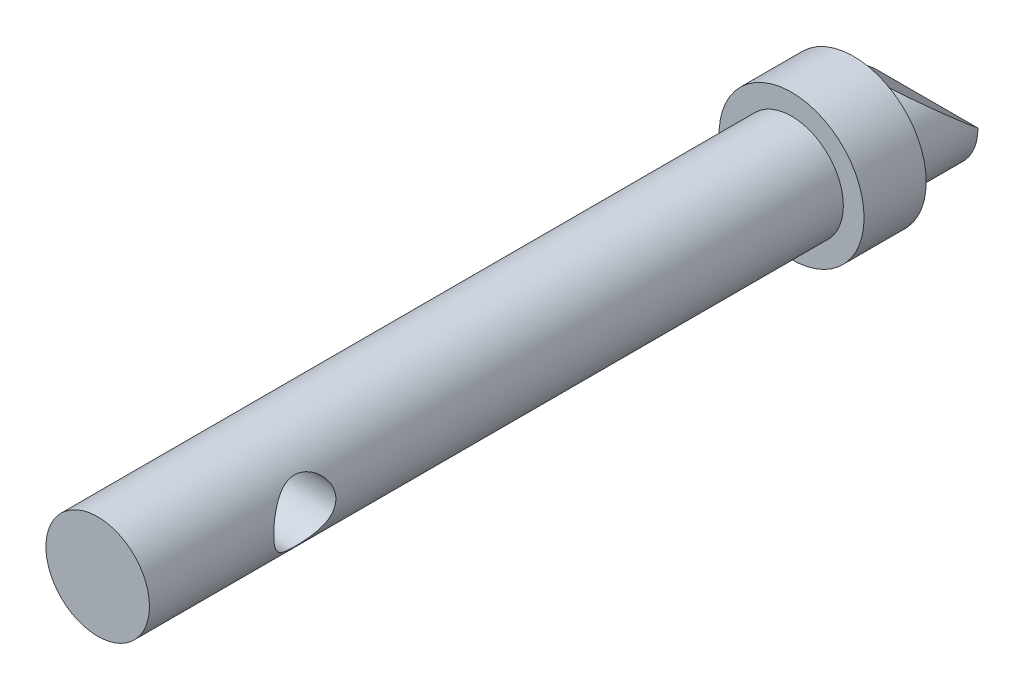
ISO-10303-21;
HEADER;
FILE_DESCRIPTION(('STEP AP214'),'2;1');
FILE_NAME('part.step','',(''),(''),'','','');
FILE_SCHEMA(('AUTOMOTIVE_DESIGN { 1 0 10303 214 1 1 1 1 }'));
ENDSEC;
DATA;
#1=APPLICATION_CONTEXT('core data for automotive mechanical design processes');
#2=APPLICATION_PROTOCOL_DEFINITION('international standard','automotive_design',2000,#1);
#3=PRODUCT_CONTEXT('',#1,'mechanical');
#4=PRODUCT('Part','Part','',(#3));
#5=PRODUCT_RELATED_PRODUCT_CATEGORY('part','',(#4));
#6=PRODUCT_DEFINITION_FORMATION('','',#4);
#7=PRODUCT_DEFINITION_CONTEXT('part definition',#1,'design');
#8=PRODUCT_DEFINITION('design','',#6,#7);
#9=PRODUCT_DEFINITION_SHAPE('','',#8);
#10=(LENGTH_UNIT() NAMED_UNIT(*) SI_UNIT(.MILLI.,.METRE.));
#11=(NAMED_UNIT(*) PLANE_ANGLE_UNIT() SI_UNIT($,.RADIAN.));
#12=(NAMED_UNIT(*) SI_UNIT($,.STERADIAN.) SOLID_ANGLE_UNIT());
#13=UNCERTAINTY_MEASURE_WITH_UNIT(LENGTH_MEASURE(1.E-05),#10,'distance_accuracy_value','');
#14=(GEOMETRIC_REPRESENTATION_CONTEXT(3) GLOBAL_UNCERTAINTY_ASSIGNED_CONTEXT((#13)) GLOBAL_UNIT_ASSIGNED_CONTEXT((#10,
#11,#12)) REPRESENTATION_CONTEXT('',''));
#15=CARTESIAN_POINT('',(0.,0.,0.));
#16=DIRECTION('',(0.,0.,1.));
#17=DIRECTION('',(1.,0.,0.));
#18=AXIS2_PLACEMENT_3D('',#15,#16,#17);
#19=CARTESIAN_POINT('',(0.,0.,-5.));
#20=DIRECTION('',(0.,0.,1.));
#21=DIRECTION('',(1.,0.,0.));
#22=AXIS2_PLACEMENT_3D('',#19,#20,#21);
#23=CYLINDRICAL_SURFACE('',#22,2.5);
#24=CARTESIAN_POINT('',(-2.5,0.,29.));
#25=CARTESIAN_POINT('',(-2.49999625789732,-0.0767298334620157,28.9999959089901));
#26=CARTESIAN_POINT('',(-2.4964290461501,-0.153582320644178,28.9940713290737));
#27=CARTESIAN_POINT('',(-2.48249903608568,-0.304975509530679,28.9706756804847));
#28=CARTESIAN_POINT('',(-2.47211948032719,-0.379510034596047,28.9531761381458));
#29=CARTESIAN_POINT('',(-2.44561558054488,-0.523751827790836,28.9076136388331));
#30=CARTESIAN_POINT('',(-2.42951973272944,-0.593481028226566,28.8796030418368));
#31=CARTESIAN_POINT('',(-2.39295367626407,-0.727030318214659,28.814139666859));
#32=CARTESIAN_POINT('',(-2.37248455380255,-0.790851869416383,28.7766892330313));
#33=CARTESIAN_POINT('',(-2.32705360719088,-0.916299278999314,28.6902251732914));
#34=CARTESIAN_POINT('',(-2.30186792195985,-0.977384020081414,28.6405463046486));
#35=CARTESIAN_POINT('',(-2.25030439279634,-1.09088270411891,28.5325327961717));
#36=CARTESIAN_POINT('',(-2.22392505153571,-1.14328534948112,28.4741870628127));
#37=CARTESIAN_POINT('',(-2.1691106699591,-1.24444996762974,28.3420764895033));
#38=CARTESIAN_POINT('',(-2.14082017703649,-1.29197766378809,28.2672982290187));
#39=CARTESIAN_POINT('',(-2.08938301412124,-1.37361437764896,28.1091534267569));
#40=CARTESIAN_POINT('',(-2.06622802273938,-1.40774517335159,28.0258011037524));
#41=CARTESIAN_POINT('',(-2.0335462966093,-1.45440601714221,27.8734035493468));
#42=CARTESIAN_POINT('',(-2.02207883137591,-1.47016197246826,27.8057640013897));
#43=CARTESIAN_POINT('',(-2.00590308295503,-1.49216172340475,27.6681962841696));
#44=CARTESIAN_POINT('',(-2.00118639643759,-1.49841734556836,27.5982710712455));
#45=CARTESIAN_POINT('',(-1.99920922463856,-1.50105508796009,27.4579885057827));
#46=CARTESIAN_POINT('',(-2.00196337012718,-1.49741783408419,27.3876305749068));
#47=CARTESIAN_POINT('',(-2.01453261443741,-1.48046060478828,27.2487212245724));
#48=CARTESIAN_POINT('',(-2.02435302432226,-1.46713334620103,27.1801712041526));
#49=CARTESIAN_POINT('',(-2.04953186944258,-1.43173921881793,27.0474697578719));
#50=CARTESIAN_POINT('',(-2.06481711652537,-1.40978748666087,26.9832729460755));
#51=CARTESIAN_POINT('',(-2.09927051350828,-1.35795061770837,26.8593050090719));
#52=CARTESIAN_POINT('',(-2.11844008623465,-1.32806257259705,26.7995355165761));
#53=CARTESIAN_POINT('',(-2.16255327268985,-1.25517983184583,26.6750159028772));
#54=CARTESIAN_POINT('',(-2.18792043372992,-1.21080724397723,26.6112219070451));
#55=CARTESIAN_POINT('',(-2.23930599764381,-1.11291092784003,26.491323516333));
#56=CARTESIAN_POINT('',(-2.26532500262149,-1.05937845100579,26.4352265660235));
#57=CARTESIAN_POINT('',(-2.31935504958317,-0.935811834382969,26.3243870181782));
#58=CARTESIAN_POINT('',(-2.34713836268532,-0.86451768270496,26.270922693984));
#59=CARTESIAN_POINT('',(-2.3977242843398,-0.712276050459002,26.1768779528021));
#60=CARTESIAN_POINT('',(-2.42052955425515,-0.631333763943566,26.13629064621));
#61=CARTESIAN_POINT('',(-2.45730392066151,-0.467197585268208,26.0720678172041));
#62=CARTESIAN_POINT('',(-2.47173957439704,-0.384467624173582,26.0475246442841));
#63=CARTESIAN_POINT('',(-2.4921884281355,-0.215047895144642,26.0129888025946));
#64=CARTESIAN_POINT('',(-2.49821172952738,-0.128363005661321,26.0029786822464));
#65=CARTESIAN_POINT('',(-2.5009057037461,0.0337146143773946,25.9984921523217));
#66=CARTESIAN_POINT('',(-2.49873521714286,0.109042473418716,26.0020911449148));
#67=CARTESIAN_POINT('',(-2.48778712087048,0.257829401986059,26.0204258530719));
#68=CARTESIAN_POINT('',(-2.47900964518037,0.331288509376104,26.0351613428058));
#69=CARTESIAN_POINT('',(-2.4559479244219,0.472574932157612,26.0745434328125));
#70=CARTESIAN_POINT('',(-2.44180275662555,0.540495750928483,26.0989403490735));
#71=CARTESIAN_POINT('',(-2.40913880862844,0.671265749087262,26.1566773763653));
#72=CARTESIAN_POINT('',(-2.39061916586511,0.734113924963907,26.1900192513467));
#73=CARTESIAN_POINT('',(-2.3484549623736,0.860006262823863,26.2685569792087));
#74=CARTESIAN_POINT('',(-2.3244780273988,0.922394150456837,26.3146238290784));
#75=CARTESIAN_POINT('',(-2.27474265574731,1.03902603131014,26.4153913934886));
#76=CARTESIAN_POINT('',(-2.2489821658636,1.09326040273738,26.4701021548525));
#77=CARTESIAN_POINT('',(-2.19445423909891,1.19931996735579,26.5949103900371));
#78=CARTESIAN_POINT('',(-2.16573241746291,1.24991019630915,26.6660838854655));
#79=CARTESIAN_POINT('',(-2.1121618206671,1.33845238915667,26.8172160245682));
#80=CARTESIAN_POINT('',(-2.0873089799769,1.37641766769781,26.8971652938928));
#81=CARTESIAN_POINT('',(-2.04984909240519,1.43142578795776,27.0462430223067));
#82=CARTESIAN_POINT('',(-2.03575659328728,1.4512162533619,27.1139803123586));
#83=CARTESIAN_POINT('',(-2.01409605743544,1.48113663905972,27.2525320780801));
#84=CARTESIAN_POINT('',(-2.00651897642721,1.49127995297631,27.3233421443278));
#85=CARTESIAN_POINT('',(-1.99900446616267,1.50134130416631,27.466376947597));
#86=CARTESIAN_POINT('',(-1.99909576445937,1.50122089107869,27.538605990687));
#87=CARTESIAN_POINT('',(-2.0069771789285,1.49066472959328,27.6818944356095));
#88=CARTESIAN_POINT('',(-2.0147714813882,1.48022337215759,27.7529531800806));
#89=CARTESIAN_POINT('',(-2.0363318524298,1.45040174148913,27.8884884175722));
#90=CARTESIAN_POINT('',(-2.04979211805581,1.43147636845351,27.9531170943069));
#91=CARTESIAN_POINT('',(-2.08105501960152,1.38563242076993,28.0783372544742));
#92=CARTESIAN_POINT('',(-2.09885929040482,1.35871083588479,28.1389272069606));
#93=CARTESIAN_POINT('',(-2.14012990550917,1.29289245555732,28.2643198572208));
#94=CARTESIAN_POINT('',(-2.1640458758264,1.25279167675753,28.3283411038543));
#95=CARTESIAN_POINT('',(-2.21320127030768,1.16375698389084,28.4493800726173));
#96=CARTESIAN_POINT('',(-2.23844177205021,1.11481579607798,28.5063919621526));
#97=CARTESIAN_POINT('',(-2.29225690291476,1.00009777425734,28.6213509491317));
#98=CARTESIAN_POINT('',(-2.32070308663658,0.932876819313901,28.6779310748962));
#99=CARTESIAN_POINT('',(-2.37365428872367,0.788462434445586,28.7790978558633));
#100=CARTESIAN_POINT('',(-2.39815789310936,0.711265444501537,28.8236802119848));
#101=CARTESIAN_POINT('',(-2.43985578654394,0.551125230801451,28.8977858075737));
#102=CARTESIAN_POINT('',(-2.45725077479787,0.468430086957212,28.9277280649268));
#103=CARTESIAN_POINT('',(-2.48366273001246,0.297973306118806,28.972724695211));
#104=CARTESIAN_POINT('',(-2.49271125871485,0.21023209964861,28.987835167857));
#105=CARTESIAN_POINT('',(-2.49802001168187,0.101558096917533,28.9966974547087));
#106=CARTESIAN_POINT('',(-2.49876114656362,0.0812762590282753,28.9979344173061));
#107=CARTESIAN_POINT('',(-2.49975164517367,0.0406658206871112,28.9995862463709));
#108=CARTESIAN_POINT('',(-2.50000099184316,0.0203372186375689,29.0000010843209));
#109=CARTESIAN_POINT('',(-2.5,0.,29.));
#110=B_SPLINE_CURVE_WITH_KNOTS('',3,(#24,#25,#26,#27,#28,#29,#30,#31,#32,#33,#34,#35,#36,#37,
#38,#39,#40,#41,#42,#43,#44,#45,#46,#47,#48,#49,#50,#51,#52,#53,#54,#55,#56,#57,#58,#59,#60,#61,
#62,#63,#64,#65,#66,#67,#68,#69,#70,#71,#72,#73,#74,#75,#76,#77,#78,#79,#80,#81,#82,#83,#84,#85,
#86,#87,#88,#89,#90,#91,#92,#93,#94,#95,#96,#97,#98,#99,#100,#101,#102,#103,#104,#105,#106,#107,
#108,#109),.UNSPECIFIED.,.T.,.F.,(4,2,2,2,2,2,2,2,2,2,2,2,2,2,2,2,2,2,2,2,2,2,2,2,2,2,2,2,2,2,2,
2,2,2,2,2,2,2,2,2,2,2,4),(0.,0.230102237548649,0.460772627520012,0.690308884600011,
0.919788197992275,1.16681590732472,1.414162579348,1.69183813189807,1.96906040692091,
2.17933829855633,2.38935420916578,2.59978170870726,2.81036753273872,3.01823267593207,
3.22617409809868,3.47046995225163,3.71500044803674,3.99360957884691,4.27206939275324,
4.53296790696559,4.79355286918236,5.01875602722426,5.24395461863455,5.46367785689772,
5.68344445659025,5.92601365818362,6.16886690081836,6.44336762428009,6.71757792616456,
6.93257787314692,7.14727888733319,7.36278425777433,7.57840681155725,7.78364098331143,
7.98895251523036,8.22578610052287,8.46281544370208,8.73854311775519,9.01436946031986,
9.28175654462677,9.54812832184449,9.60911473335177,9.67010326027641),.UNSPECIFIED.);
#111=CARTESIAN_POINT('',(-2.5,0.,29.));
#112=VERTEX_POINT('',#111);
#113=EDGE_CURVE('E58',#112,#112,#110,.T.);
#114=ORIENTED_EDGE('',*,*,#113,.T.);
#115=EDGE_LOOP('',(#114));
#116=FACE_BOUND('',#115,.T.);
#117=CARTESIAN_POINT('',(0.,0.,1.5));
#118=DIRECTION('',(0.,0.,1.));
#119=DIRECTION('',(1.,0.,0.));
#120=AXIS2_PLACEMENT_3D('',#117,#118,#119);
#121=CIRCLE('',#120,2.5);
#122=CARTESIAN_POINT('',(2.5,0.,1.5));
#123=VERTEX_POINT('',#122);
#124=EDGE_CURVE('E45',#123,#123,#121,.F.);
#125=ORIENTED_EDGE('',*,*,#124,.F.);
#126=EDGE_LOOP('',(#125));
#127=FACE_BOUND('',#126,.T.);
#128=CARTESIAN_POINT('',(0.,0.,35.));
#129=DIRECTION('',(0.,0.,1.));
#130=DIRECTION('',(1.,0.,0.));
#131=AXIS2_PLACEMENT_3D('',#128,#129,#130);
#132=CIRCLE('',#131,2.5);
#133=CARTESIAN_POINT('',(2.5,0.,35.));
#134=VERTEX_POINT('',#133);
#135=EDGE_CURVE('E63',#134,#134,#132,.T.);
#136=ORIENTED_EDGE('',*,*,#135,.F.);
#137=EDGE_LOOP('',(#136));
#138=FACE_BOUND('',#137,.T.);
#139=CARTESIAN_POINT('',(2.5,0.,26.));
#140=CARTESIAN_POINT('',(2.49999625789732,-0.0767298334620157,26.0000040910099));
#141=CARTESIAN_POINT('',(2.4964290461501,-0.153582320644178,26.0059286709263));
#142=CARTESIAN_POINT('',(2.48249903608568,-0.304975509530679,26.0293243195153));
#143=CARTESIAN_POINT('',(2.47211948032719,-0.379510034596047,26.0468238618542));
#144=CARTESIAN_POINT('',(2.44561558054488,-0.523751827790836,26.0923863611669));
#145=CARTESIAN_POINT('',(2.42951973272944,-0.593481028226565,26.1203969581632));
#146=CARTESIAN_POINT('',(2.39295367626407,-0.727030318214658,26.185860333141));
#147=CARTESIAN_POINT('',(2.37248455380255,-0.790851869416382,26.2233107669687));
#148=CARTESIAN_POINT('',(2.32705360719088,-0.916299278999314,26.3097748267086));
#149=CARTESIAN_POINT('',(2.30186792195985,-0.977384020081414,26.3594536953514));
#150=CARTESIAN_POINT('',(2.25030439279634,-1.09088270411891,26.4674672038283));
#151=CARTESIAN_POINT('',(2.22392505153571,-1.14328534948112,26.5258129371873));
#152=CARTESIAN_POINT('',(2.1691106699591,-1.24444996762974,26.6579235104967));
#153=CARTESIAN_POINT('',(2.14082017703649,-1.29197766378809,26.7327017709813));
#154=CARTESIAN_POINT('',(2.08938301412124,-1.37361437764896,26.8908465732431));
#155=CARTESIAN_POINT('',(2.06622802273938,-1.40774517335159,26.9741988962476));
#156=CARTESIAN_POINT('',(2.0335462966093,-1.45440601714221,27.1265964506532));
#157=CARTESIAN_POINT('',(2.02207883137591,-1.47016197246826,27.1942359986103));
#158=CARTESIAN_POINT('',(2.00590308295503,-1.49216172340475,27.3318037158304));
#159=CARTESIAN_POINT('',(2.00118639643759,-1.49841734556836,27.4017289287545));
#160=CARTESIAN_POINT('',(1.99920922463856,-1.50105508796009,27.5420114942173));
#161=CARTESIAN_POINT('',(2.00196337012718,-1.49741783408419,27.6123694250932));
#162=CARTESIAN_POINT('',(2.01453261443741,-1.48046060478828,27.7512787754276));
#163=CARTESIAN_POINT('',(2.02435302432226,-1.46713334620103,27.8198287958474));
#164=CARTESIAN_POINT('',(2.04953186944258,-1.43173921881793,27.9525302421281));
#165=CARTESIAN_POINT('',(2.06481711652537,-1.40978748666087,28.0167270539245));
#166=CARTESIAN_POINT('',(2.09927051350828,-1.35795061770837,28.1406949909281));
#167=CARTESIAN_POINT('',(2.11844008623465,-1.32806257259705,28.2004644834239));
#168=CARTESIAN_POINT('',(2.16255327268985,-1.25517983184583,28.3249840971228));
#169=CARTESIAN_POINT('',(2.18792043372992,-1.21080724397723,28.3887780929549));
#170=CARTESIAN_POINT('',(2.23930599764381,-1.11291092784003,28.508676483667));
#171=CARTESIAN_POINT('',(2.26532500262149,-1.05937845100579,28.5647734339765));
#172=CARTESIAN_POINT('',(2.31935504958317,-0.935811834382969,28.6756129818218));
#173=CARTESIAN_POINT('',(2.34713836268532,-0.86451768270496,28.729077306016));
#174=CARTESIAN_POINT('',(2.3977242843398,-0.712276050459002,28.8231220471979));
#175=CARTESIAN_POINT('',(2.42052955425515,-0.631333763943566,28.86370935379));
#176=CARTESIAN_POINT('',(2.45730392066151,-0.467197585268208,28.9279321827959));
#177=CARTESIAN_POINT('',(2.47173957439704,-0.384467624173582,28.9524753557159));
#178=CARTESIAN_POINT('',(2.4921884281355,-0.215047895144641,28.9870111974054));
#179=CARTESIAN_POINT('',(2.49821172952738,-0.128363005661321,28.9970213177536));
#180=CARTESIAN_POINT('',(2.5009057037461,0.0337146143773946,29.0015078476783));
#181=CARTESIAN_POINT('',(2.49873521714286,0.109042473418716,28.9979088550852));
#182=CARTESIAN_POINT('',(2.48778712087048,0.257829401986059,28.9795741469281));
#183=CARTESIAN_POINT('',(2.47900964518037,0.331288509376104,28.9648386571942));
#184=CARTESIAN_POINT('',(2.4559479244219,0.472574932157612,28.9254565671875));
#185=CARTESIAN_POINT('',(2.44180275662555,0.540495750928483,28.9010596509265));
#186=CARTESIAN_POINT('',(2.40913880862844,0.671265749087262,28.8433226236347));
#187=CARTESIAN_POINT('',(2.39061916586511,0.734113924963907,28.8099807486533));
#188=CARTESIAN_POINT('',(2.3484549623736,0.860006262823862,28.7314430207913));
#189=CARTESIAN_POINT('',(2.3244780273988,0.922394150456835,28.6853761709216));
#190=CARTESIAN_POINT('',(2.27474265574732,1.03902603131014,28.5846086065114));
#191=CARTESIAN_POINT('',(2.2489821658636,1.09326040273738,28.5298978451475));
#192=CARTESIAN_POINT('',(2.19445423909891,1.19931996735579,28.4050896099629));
#193=CARTESIAN_POINT('',(2.16573241746291,1.24991019630914,28.3339161145345));
#194=CARTESIAN_POINT('',(2.1121618206671,1.33845238915667,28.1827839754318));
#195=CARTESIAN_POINT('',(2.0873089799769,1.37641766769781,28.1028347061072));
#196=CARTESIAN_POINT('',(2.04984909240519,1.43142578795776,27.9537569776933));
#197=CARTESIAN_POINT('',(2.03575659328728,1.4512162533619,27.8860196876414));
#198=CARTESIAN_POINT('',(2.01409605743544,1.48113663905972,27.7474679219199));
#199=CARTESIAN_POINT('',(2.00651897642721,1.49127995297631,27.6766578556722));
#200=CARTESIAN_POINT('',(1.99900446616267,1.50134130416631,27.533623052403));
#201=CARTESIAN_POINT('',(1.99909576445937,1.50122089107869,27.461394009313));
#202=CARTESIAN_POINT('',(2.0069771789285,1.49066472959328,27.3181055643905));
#203=CARTESIAN_POINT('',(2.0147714813882,1.48022337215759,27.2470468199194));
#204=CARTESIAN_POINT('',(2.0363318524298,1.45040174148913,27.1115115824278));
#205=CARTESIAN_POINT('',(2.04979211805581,1.43147636845351,27.0468829056931));
#206=CARTESIAN_POINT('',(2.08105501960152,1.38563242076993,26.9216627455258));
#207=CARTESIAN_POINT('',(2.09885929040482,1.35871083588479,26.8610727930394));
#208=CARTESIAN_POINT('',(2.14012990550917,1.29289245555732,26.7356801427792));
#209=CARTESIAN_POINT('',(2.1640458758264,1.25279167675753,26.6716588961457));
#210=CARTESIAN_POINT('',(2.21320127030768,1.16375698389084,26.5506199273827));
#211=CARTESIAN_POINT('',(2.23844177205021,1.11481579607798,26.4936080378474));
#212=CARTESIAN_POINT('',(2.29225690291476,1.00009777425734,26.3786490508683));
#213=CARTESIAN_POINT('',(2.32070308663658,0.932876819313901,26.3220689251038));
#214=CARTESIAN_POINT('',(2.37365428872367,0.788462434445586,26.2209021441367));
#215=CARTESIAN_POINT('',(2.39815789310936,0.711265444501537,26.1763197880152));
#216=CARTESIAN_POINT('',(2.43985578654394,0.551125230801451,26.1022141924263));
#217=CARTESIAN_POINT('',(2.45725077479787,0.468430086957211,26.0722719350732));
#218=CARTESIAN_POINT('',(2.48366273001246,0.297973306118805,26.027275304789));
#219=CARTESIAN_POINT('',(2.49271125871485,0.210232099648609,26.012164832143));
#220=CARTESIAN_POINT('',(2.49802001168187,0.101558096917533,26.0033025452913));
#221=CARTESIAN_POINT('',(2.49876114656362,0.0812762590282753,26.0020655826939));
#222=CARTESIAN_POINT('',(2.49975164517367,0.0406658206871112,26.0004137536291));
#223=CARTESIAN_POINT('',(2.50000099184316,0.0203372186375689,25.9999989156791));
#224=CARTESIAN_POINT('',(2.5,0.,26.));
#225=B_SPLINE_CURVE_WITH_KNOTS('',3,(#139,#140,#141,#142,#143,#144,#145,#146,#147,#148,#149,
#150,#151,#152,#153,#154,#155,#156,#157,#158,#159,#160,#161,#162,#163,#164,#165,#166,#167,#168,
#169,#170,#171,#172,#173,#174,#175,#176,#177,#178,#179,#180,#181,#182,#183,#184,#185,#186,#187,
#188,#189,#190,#191,#192,#193,#194,#195,#196,#197,#198,#199,#200,#201,#202,#203,#204,#205,#206,
#207,#208,#209,#210,#211,#212,#213,#214,#215,#216,#217,#218,#219,#220,#221,#222,#223,#224),
.UNSPECIFIED.,.T.,.F.,(4,2,2,2,2,2,2,2,2,2,2,2,2,2,2,2,2,2,2,2,2,2,2,2,2,2,2,2,2,2,2,2,2,2,2,2,
2,2,2,2,2,2,4),(0.,0.230102237548649,0.460772627520012,0.69030888460001,0.919788197992275,
1.16681590732472,1.414162579348,1.69183813189807,1.96906040692091,2.17933829855633,
2.38935420916578,2.59978170870725,2.81036753273872,3.01823267593207,3.22617409809868,
3.47046995225163,3.71500044803674,3.99360957884691,4.27206939275324,4.53296790696559,
4.79355286918236,5.01875602722426,5.24395461863455,5.46367785689772,5.68344445659025,
5.92601365818362,6.16886690081836,6.44336762428009,6.71757792616456,6.93257787314693,
7.14727888733319,7.36278425777433,7.57840681155726,7.78364098331143,7.98895251523036,
8.22578610052287,8.46281544370209,8.7385431177552,9.01436946031986,9.28175654462678,
9.54812832184449,9.60911473335178,9.67010326027641),.UNSPECIFIED.);
#226=CARTESIAN_POINT('',(2.5,0.,26.));
#227=VERTEX_POINT('',#226);
#228=EDGE_CURVE('E80',#227,#227,#225,.T.);
#229=ORIENTED_EDGE('',*,*,#228,.T.);
#230=EDGE_LOOP('',(#229));
#231=FACE_BOUND('',#230,.T.);
#232=ADVANCED_FACE('F37',(#116,#127,#138,#231),#23,.T.);
#233=CARTESIAN_POINT('',(0.,0.,-5.));
#234=DIRECTION('',(0.,-0.768221279597376,0.64018439966448));
#235=DIRECTION('',(0.,0.64018439966448,0.768221279597376));
#236=AXIS2_PLACEMENT_3D('',#233,#234,#235);
#237=ELLIPSE('',#236,3.90512483795333,2.5);
#238=CARTESIAN_POINT('',(-2.5,0.,-5.));
#239=VERTEX_POINT('',#238);
#240=CARTESIAN_POINT('',(2.5,0.,-5.));
#241=VERTEX_POINT('',#240);
#242=EDGE_CURVE('E51',#239,#241,#237,.F.);
#243=ORIENTED_EDGE('',*,*,#242,.F.);
#244=CARTESIAN_POINT('',(0.,0.,-5.));
#245=DIRECTION('',(0.,0.,1.));
#246=DIRECTION('',(1.,0.,0.));
#247=AXIS2_PLACEMENT_3D('',#244,#245,#246);
#248=CIRCLE('',#247,2.5);
#249=EDGE_CURVE('E57',#239,#241,#248,.T.);
#250=ORIENTED_EDGE('',*,*,#249,.T.);
#251=EDGE_LOOP('',(#243,#250));
#252=FACE_BOUND('',#251,.T.);
#253=CARTESIAN_POINT('',(0.,0.,-1.5));
#254=DIRECTION('',(0.,0.,1.));
#255=DIRECTION('',(1.,0.,0.));
#256=AXIS2_PLACEMENT_3D('',#253,#254,#255);
#257=CIRCLE('',#256,2.5);
#258=CARTESIAN_POINT('',(2.5,0.,-1.5));
#259=VERTEX_POINT('',#258);
#260=EDGE_CURVE('E68',#259,#259,#257,.F.);
#261=ORIENTED_EDGE('',*,*,#260,.T.);
#262=EDGE_LOOP('',(#261));
#263=FACE_BOUND('',#262,.T.);
#264=ADVANCED_FACE('F54',(#252,#263),#23,.T.);
#265=CARTESIAN_POINT('',(0.,0.,-5.));
#266=DIRECTION('',(0.,0.,1.));
#267=DIRECTION('',(1.,0.,0.));
#268=AXIS2_PLACEMENT_3D('',#265,#266,#267);
#269=PLANE('',#268);
#270=ORIENTED_EDGE('',*,*,#249,.F.);
#271=DIRECTION('',(1.,0.,0.));
#272=VECTOR('',#271,1.);
#273=CARTESIAN_POINT('',(0.,0.,-5.));
#274=LINE('',#273,#272);
#275=EDGE_CURVE('E11',#239,#241,#274,.T.);
#276=ORIENTED_EDGE('',*,*,#275,.T.);
#277=EDGE_LOOP('',(#270,#276));
#278=FACE_BOUND('',#277,.T.);
#279=ADVANCED_FACE('F62',(#278),#269,.F.);
#280=CARTESIAN_POINT('',(0.,0.,-1.5));
#281=DIRECTION('',(0.,0.,1.));
#282=DIRECTION('',(1.,0.,0.));
#283=AXIS2_PLACEMENT_3D('',#280,#281,#282);
#284=CYLINDRICAL_SURFACE('',#283,3.5);
#285=CARTESIAN_POINT('',(0.,0.,-1.5));
#286=DIRECTION('',(0.,0.,1.));
#287=DIRECTION('',(1.,0.,0.));
#288=AXIS2_PLACEMENT_3D('',#285,#286,#287);
#289=CIRCLE('',#288,3.5);
#290=CARTESIAN_POINT('',(3.5,0.,-1.5));
#291=VERTEX_POINT('',#290);
#292=EDGE_CURVE('E74',#291,#291,#289,.T.);
#293=ORIENTED_EDGE('',*,*,#292,.T.);
#294=EDGE_LOOP('',(#293));
#295=FACE_BOUND('',#294,.T.);
#296=CARTESIAN_POINT('',(0.,0.,1.5));
#297=DIRECTION('',(0.,0.,1.));
#298=DIRECTION('',(1.,0.,0.));
#299=AXIS2_PLACEMENT_3D('',#296,#297,#298);
#300=CIRCLE('',#299,3.5);
#301=CARTESIAN_POINT('',(3.5,0.,1.5));
#302=VERTEX_POINT('',#301);
#303=EDGE_CURVE('E122',#302,#302,#300,.T.);
#304=ORIENTED_EDGE('',*,*,#303,.F.);
#305=EDGE_LOOP('',(#304));
#306=FACE_BOUND('',#305,.T.);
#307=ADVANCED_FACE('F99',(#295,#306),#284,.T.);
#308=CARTESIAN_POINT('',(0.,0.,-1.5));
#309=DIRECTION('',(0.,0.,1.));
#310=DIRECTION('',(1.,0.,0.));
#311=AXIS2_PLACEMENT_3D('',#308,#309,#310);
#312=PLANE('',#311);
#313=ORIENTED_EDGE('',*,*,#260,.F.);
#314=EDGE_LOOP('',(#313));
#315=FACE_BOUND('',#314,.T.);
#316=ORIENTED_EDGE('',*,*,#292,.F.);
#317=EDGE_LOOP('',(#316));
#318=FACE_BOUND('',#317,.T.);
#319=ADVANCED_FACE('F95',(#315,#318),#312,.F.);
#320=CARTESIAN_POINT('',(0.,0.,1.5));
#321=DIRECTION('',(0.,0.,1.));
#322=DIRECTION('',(1.,0.,0.));
#323=AXIS2_PLACEMENT_3D('',#320,#321,#322);
#324=PLANE('',#323);
#325=ORIENTED_EDGE('',*,*,#124,.T.);
#326=EDGE_LOOP('',(#325));
#327=FACE_BOUND('',#326,.T.);
#328=ORIENTED_EDGE('',*,*,#303,.T.);
#329=EDGE_LOOP('',(#328));
#330=FACE_BOUND('',#329,.T.);
#331=ADVANCED_FACE('F91',(#327,#330),#324,.T.);
#332=CARTESIAN_POINT('',(0.,0.,35.));
#333=DIRECTION('',(0.,0.,1.));
#334=DIRECTION('',(1.,0.,0.));
#335=AXIS2_PLACEMENT_3D('',#332,#333,#334);
#336=PLANE('',#335);
#337=ORIENTED_EDGE('',*,*,#135,.T.);
#338=EDGE_LOOP('',(#337));
#339=FACE_BOUND('',#338,.T.);
#340=ADVANCED_FACE('F89',(#339),#336,.T.);
#341=CARTESIAN_POINT('',(3.5,0.,27.5));
#342=DIRECTION('',(-1.,0.,0.));
#343=DIRECTION('',(0.,0.,1.));
#344=AXIS2_PLACEMENT_3D('',#341,#342,#343);
#345=CYLINDRICAL_SURFACE('',#344,1.5);
#346=ORIENTED_EDGE('',*,*,#228,.F.);
#347=EDGE_LOOP('',(#346));
#348=FACE_BOUND('',#347,.T.);
#349=ORIENTED_EDGE('',*,*,#113,.F.);
#350=EDGE_LOOP('',(#349));
#351=FACE_BOUND('',#350,.T.);
#352=ADVANCED_FACE('F84',(#348,#351),#345,.F.);
#353=CARTESIAN_POINT('',(-3.5,0.,-5.));
#354=DIRECTION('',(0.,-0.768221279597376,0.64018439966448));
#355=DIRECTION('',(0.,-0.64018439966448,-0.768221279597376));
#356=AXIS2_PLACEMENT_3D('',#353,#354,#355);
#357=PLANE('',#356);
#358=ORIENTED_EDGE('',*,*,#242,.T.);
#359=ORIENTED_EDGE('',*,*,#275,.F.);
#360=EDGE_LOOP('',(#358,#359));
#361=FACE_BOUND('',#360,.T.);
#362=ADVANCED_FACE('F60',(#361),#357,.F.);
#363=CLOSED_SHELL('',(#232,#264,#279,#307,#319,#331,#340,#352,#362));
#364=MANIFOLD_SOLID_BREP('B2',#363);
#365=ADVANCED_BREP_SHAPE_REPRESENTATION('',(#18,#364),#14);
#366=SHAPE_DEFINITION_REPRESENTATION(#9,#365);
ENDSEC;
END-ISO-10303-21;
